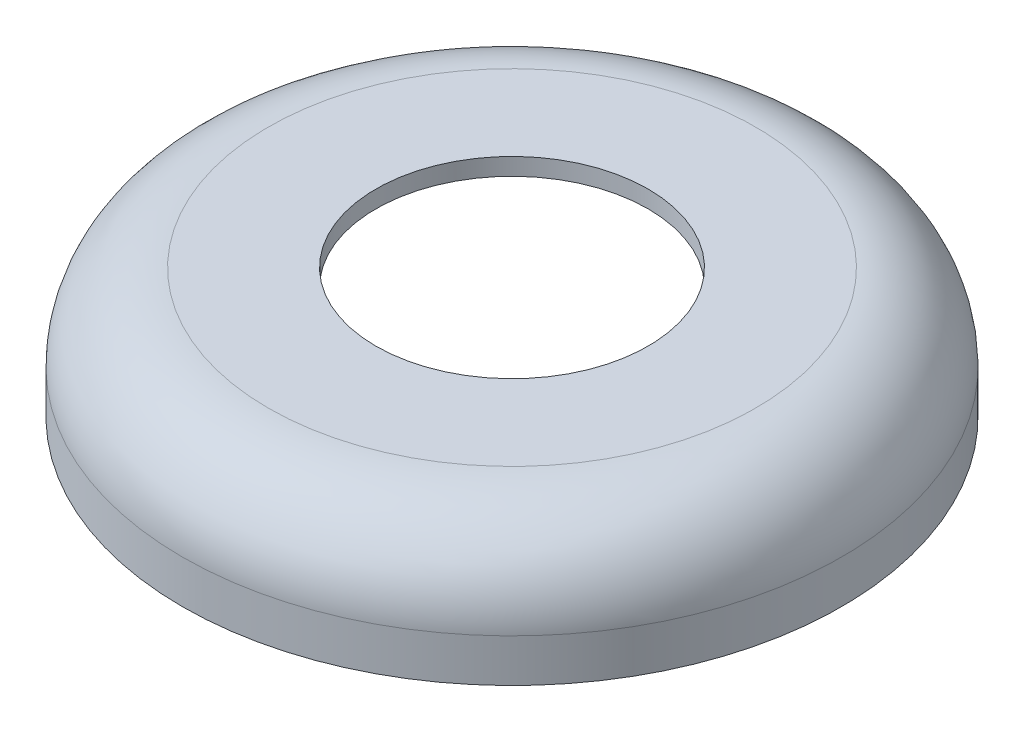
ISO-10303-21;
HEADER;
FILE_DESCRIPTION(('STEP AP214'),'2;1');
FILE_NAME('part.step','',(''),(''),'','','');
FILE_SCHEMA(('AUTOMOTIVE_DESIGN { 1 0 10303 214 1 1 1 1 }'));
ENDSEC;
DATA;
#1=APPLICATION_CONTEXT('core data for automotive mechanical design processes');
#2=APPLICATION_PROTOCOL_DEFINITION('international standard','automotive_design',2000,#1);
#3=PRODUCT_CONTEXT('',#1,'mechanical');
#4=PRODUCT('Part','Part','',(#3));
#5=PRODUCT_RELATED_PRODUCT_CATEGORY('part','',(#4));
#6=PRODUCT_DEFINITION_FORMATION('','',#4);
#7=PRODUCT_DEFINITION_CONTEXT('part definition',#1,'design');
#8=PRODUCT_DEFINITION('design','',#6,#7);
#9=PRODUCT_DEFINITION_SHAPE('','',#8);
#10=(LENGTH_UNIT() NAMED_UNIT(*) SI_UNIT(.MILLI.,.METRE.));
#11=(NAMED_UNIT(*) PLANE_ANGLE_UNIT() SI_UNIT($,.RADIAN.));
#12=(NAMED_UNIT(*) SI_UNIT($,.STERADIAN.) SOLID_ANGLE_UNIT());
#13=UNCERTAINTY_MEASURE_WITH_UNIT(LENGTH_MEASURE(1.E-05),#10,'distance_accuracy_value','');
#14=(GEOMETRIC_REPRESENTATION_CONTEXT(3) GLOBAL_UNCERTAINTY_ASSIGNED_CONTEXT((#13)) GLOBAL_UNIT_ASSIGNED_CONTEXT((#10,
#11,#12)) REPRESENTATION_CONTEXT('',''));
#15=CARTESIAN_POINT('',(0.,0.,0.));
#16=DIRECTION('',(0.,0.,1.));
#17=DIRECTION('',(1.,0.,0.));
#18=AXIS2_PLACEMENT_3D('',#15,#16,#17);
#19=CARTESIAN_POINT('',(0.,4.5,0.));
#20=DIRECTION('',(0.,-1.,0.));
#21=DIRECTION('',(0.,0.,-1.));
#22=AXIS2_PLACEMENT_3D('',#19,#20,#21);
#23=CYLINDRICAL_SURFACE('',#22,11.5);
#24=CARTESIAN_POINT('',(0.,1.5,0.));
#25=DIRECTION('',(0.,1.,0.));
#26=DIRECTION('',(0.,0.,1.));
#27=AXIS2_PLACEMENT_3D('',#24,#25,#26);
#28=CIRCLE('',#27,11.5);
#29=CARTESIAN_POINT('',(0.,1.5,11.5));
#30=VERTEX_POINT('',#29);
#31=EDGE_CURVE('E10',#30,#30,#28,.F.);
#32=ORIENTED_EDGE('',*,*,#31,.T.);
#33=EDGE_LOOP('',(#32));
#34=FACE_BOUND('',#33,.T.);
#35=CARTESIAN_POINT('',(0.,0.,0.));
#36=DIRECTION('',(0.,1.,0.));
#37=DIRECTION('',(0.,0.,1.));
#38=AXIS2_PLACEMENT_3D('',#35,#36,#37);
#39=CIRCLE('',#38,11.5);
#40=CARTESIAN_POINT('',(0.,0.,11.5));
#41=VERTEX_POINT('',#40);
#42=EDGE_CURVE('E51',#41,#41,#39,.T.);
#43=ORIENTED_EDGE('',*,*,#42,.T.);
#44=EDGE_LOOP('',(#43));
#45=FACE_BOUND('',#44,.T.);
#46=ADVANCED_FACE('F37',(#34,#45),#23,.T.);
#47=CARTESIAN_POINT('',(0.,4.5,0.));
#48=DIRECTION('',(0.,1.,0.));
#49=DIRECTION('',(0.,0.,1.));
#50=AXIS2_PLACEMENT_3D('',#47,#48,#49);
#51=PLANE('',#50);
#52=CARTESIAN_POINT('',(0.,4.5,0.));
#53=DIRECTION('',(0.,1.,0.));
#54=DIRECTION('',(0.,0.,1.));
#55=AXIS2_PLACEMENT_3D('',#52,#53,#54);
#56=CIRCLE('',#55,4.75);
#57=CARTESIAN_POINT('',(0.,4.5,4.75));
#58=VERTEX_POINT('',#57);
#59=EDGE_CURVE('E69',#58,#58,#56,.T.);
#60=ORIENTED_EDGE('',*,*,#59,.F.);
#61=EDGE_LOOP('',(#60));
#62=FACE_BOUND('',#61,.T.);
#63=CARTESIAN_POINT('',(0.,4.5,0.));
#64=DIRECTION('',(0.,1.,0.));
#65=DIRECTION('',(0.,0.,1.));
#66=AXIS2_PLACEMENT_3D('',#63,#64,#65);
#67=CIRCLE('',#66,8.5);
#68=CARTESIAN_POINT('',(0.,4.5,8.5));
#69=VERTEX_POINT('',#68);
#70=EDGE_CURVE('E46',#69,#69,#67,.T.);
#71=ORIENTED_EDGE('',*,*,#70,.T.);
#72=EDGE_LOOP('',(#71));
#73=FACE_BOUND('',#72,.T.);
#74=ADVANCED_FACE('F92',(#62,#73),#51,.T.);
#75=CARTESIAN_POINT('',(0.,0.,0.));
#76=DIRECTION('',(0.,1.,0.));
#77=DIRECTION('',(0.,0.,1.));
#78=AXIS2_PLACEMENT_3D('',#75,#76,#77);
#79=PLANE('',#78);
#80=CARTESIAN_POINT('',(0.,0.,0.));
#81=DIRECTION('',(0.,1.,0.));
#82=DIRECTION('',(0.,0.,1.));
#83=AXIS2_PLACEMENT_3D('',#80,#81,#82);
#84=CIRCLE('',#83,10.9);
#85=CARTESIAN_POINT('',(0.,0.,10.9));
#86=VERTEX_POINT('',#85);
#87=EDGE_CURVE('E58',#86,#86,#84,.T.);
#88=ORIENTED_EDGE('',*,*,#87,.T.);
#89=EDGE_LOOP('',(#88));
#90=FACE_BOUND('',#89,.T.);
#91=ORIENTED_EDGE('',*,*,#42,.F.);
#92=EDGE_LOOP('',(#91));
#93=FACE_BOUND('',#92,.T.);
#94=ADVANCED_FACE('F96',(#90,#93),#79,.F.);
#95=CARTESIAN_POINT('',(0.,1.5,0.));
#96=DIRECTION('',(0.,1.,0.));
#97=DIRECTION('',(0.,0.,1.));
#98=AXIS2_PLACEMENT_3D('',#95,#96,#97);
#99=TOROIDAL_SURFACE('',#98,8.5,3.);
#100=ORIENTED_EDGE('',*,*,#31,.F.);
#101=EDGE_LOOP('',(#100));
#102=FACE_BOUND('',#101,.T.);
#103=ORIENTED_EDGE('',*,*,#70,.F.);
#104=EDGE_LOOP('',(#103));
#105=FACE_BOUND('',#104,.T.);
#106=ADVANCED_FACE('F39',(#102,#105),#99,.T.);
#107=CARTESIAN_POINT('',(0.,4.5,0.));
#108=DIRECTION('',(0.,-1.,0.));
#109=DIRECTION('',(0.,0.,-1.));
#110=AXIS2_PLACEMENT_3D('',#107,#108,#109);
#111=CYLINDRICAL_SURFACE('',#110,10.9);
#112=CARTESIAN_POINT('',(0.,1.5,0.));
#113=DIRECTION('',(0.,-1.,0.));
#114=DIRECTION('',(0.,0.,-1.));
#115=AXIS2_PLACEMENT_3D('',#112,#113,#114);
#116=CIRCLE('',#115,10.9);
#117=CARTESIAN_POINT('',(0.,1.5,-10.9));
#118=VERTEX_POINT('',#117);
#119=EDGE_CURVE('E57',#118,#118,#116,.T.);
#120=ORIENTED_EDGE('',*,*,#119,.F.);
#121=EDGE_LOOP('',(#120));
#122=FACE_BOUND('',#121,.T.);
#123=ORIENTED_EDGE('',*,*,#87,.F.);
#124=EDGE_LOOP('',(#123));
#125=FACE_BOUND('',#124,.T.);
#126=ADVANCED_FACE('F105',(#122,#125),#111,.F.);
#127=CARTESIAN_POINT('',(0.,3.9,0.));
#128=DIRECTION('',(0.,1.,0.));
#129=DIRECTION('',(0.,0.,1.));
#130=AXIS2_PLACEMENT_3D('',#127,#128,#129);
#131=PLANE('',#130);
#132=CARTESIAN_POINT('',(0.,3.9,0.));
#133=DIRECTION('',(0.,1.,0.));
#134=DIRECTION('',(0.,0.,1.));
#135=AXIS2_PLACEMENT_3D('',#132,#133,#134);
#136=CIRCLE('',#135,4.75);
#137=CARTESIAN_POINT('',(0.,3.9,4.75));
#138=VERTEX_POINT('',#137);
#139=EDGE_CURVE('E41',#138,#138,#136,.T.);
#140=ORIENTED_EDGE('',*,*,#139,.T.);
#141=EDGE_LOOP('',(#140));
#142=FACE_BOUND('',#141,.T.);
#143=CARTESIAN_POINT('',(0.,3.9,0.));
#144=DIRECTION('',(0.,1.,0.));
#145=DIRECTION('',(0.,0.,1.));
#146=AXIS2_PLACEMENT_3D('',#143,#144,#145);
#147=CIRCLE('',#146,8.5);
#148=CARTESIAN_POINT('',(0.,3.9,8.5));
#149=VERTEX_POINT('',#148);
#150=EDGE_CURVE('E62',#149,#149,#147,.T.);
#151=ORIENTED_EDGE('',*,*,#150,.F.);
#152=EDGE_LOOP('',(#151));
#153=FACE_BOUND('',#152,.T.);
#154=ADVANCED_FACE('F78',(#142,#153),#131,.F.);
#155=CARTESIAN_POINT('',(0.,1.5,0.));
#156=DIRECTION('',(0.,1.,0.));
#157=DIRECTION('',(0.,0.,1.));
#158=AXIS2_PLACEMENT_3D('',#155,#156,#157);
#159=TOROIDAL_SURFACE('',#158,8.5,2.4);
#160=ORIENTED_EDGE('',*,*,#119,.T.);
#161=EDGE_LOOP('',(#160));
#162=FACE_BOUND('',#161,.T.);
#163=ORIENTED_EDGE('',*,*,#150,.T.);
#164=EDGE_LOOP('',(#163));
#165=FACE_BOUND('',#164,.T.);
#166=ADVANCED_FACE('F83',(#162,#165),#159,.F.);
#167=CARTESIAN_POINT('',(0.,0.,0.));
#168=DIRECTION('',(0.,1.,0.));
#169=DIRECTION('',(0.,0.,1.));
#170=AXIS2_PLACEMENT_3D('',#167,#168,#169);
#171=CYLINDRICAL_SURFACE('',#170,4.75);
#172=ORIENTED_EDGE('',*,*,#59,.T.);
#173=EDGE_LOOP('',(#172));
#174=FACE_BOUND('',#173,.T.);
#175=ORIENTED_EDGE('',*,*,#139,.F.);
#176=EDGE_LOOP('',(#175));
#177=FACE_BOUND('',#176,.T.);
#178=ADVANCED_FACE('F81',(#174,#177),#171,.F.);
#179=CLOSED_SHELL('',(#46,#74,#94,#106,#126,#154,#166,#178));
#180=MANIFOLD_SOLID_BREP('B2',#179);
#181=ADVANCED_BREP_SHAPE_REPRESENTATION('',(#18,#180),#14);
#182=SHAPE_DEFINITION_REPRESENTATION(#9,#181);
ENDSEC;
END-ISO-10303-21;
